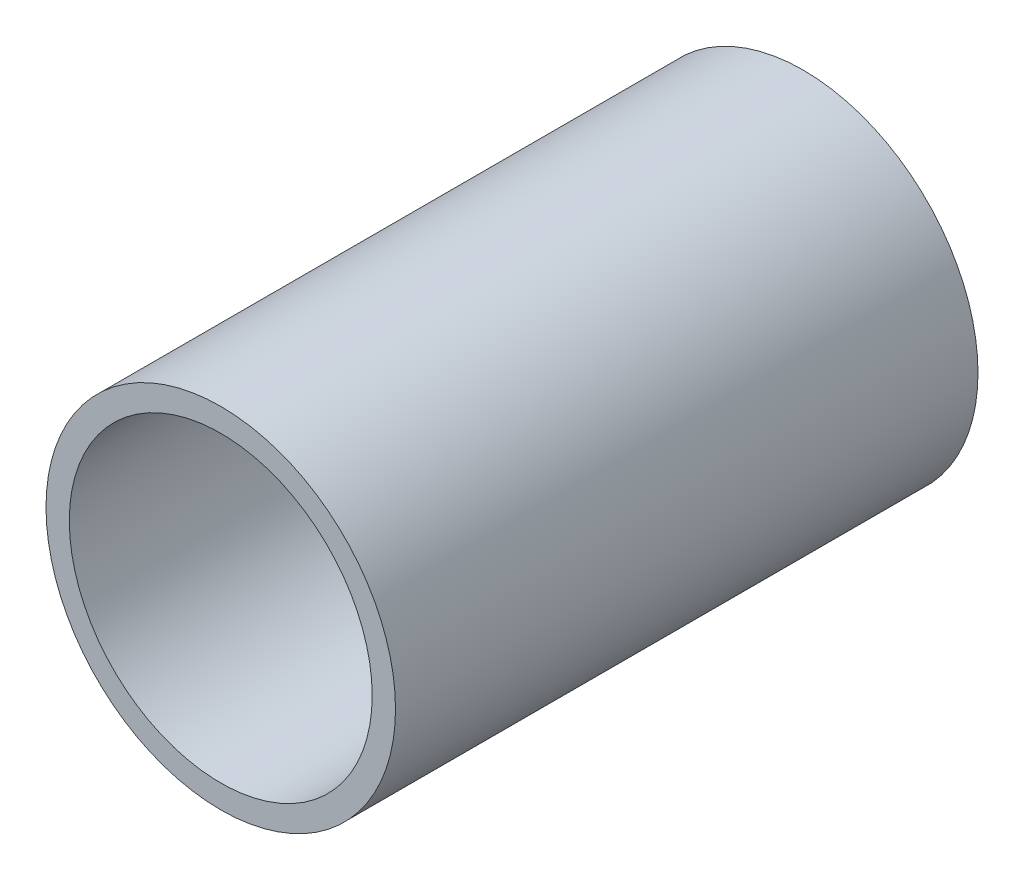
ISO-10303-21;
HEADER;
FILE_DESCRIPTION(('STEP AP214'),'2;1');
FILE_NAME('part.step','',(''),(''),'','','');
FILE_SCHEMA(('AUTOMOTIVE_DESIGN { 1 0 10303 214 1 1 1 1 }'));
ENDSEC;
DATA;
#1=APPLICATION_CONTEXT('core data for automotive mechanical design processes');
#2=APPLICATION_PROTOCOL_DEFINITION('international standard','automotive_design',2000,#1);
#3=PRODUCT_CONTEXT('',#1,'mechanical');
#4=PRODUCT('Part','Part','',(#3));
#5=PRODUCT_RELATED_PRODUCT_CATEGORY('part','',(#4));
#6=PRODUCT_DEFINITION_FORMATION('','',#4);
#7=PRODUCT_DEFINITION_CONTEXT('part definition',#1,'design');
#8=PRODUCT_DEFINITION('design','',#6,#7);
#9=PRODUCT_DEFINITION_SHAPE('','',#8);
#10=(LENGTH_UNIT() NAMED_UNIT(*) SI_UNIT(.MILLI.,.METRE.));
#11=(NAMED_UNIT(*) PLANE_ANGLE_UNIT() SI_UNIT($,.RADIAN.));
#12=(NAMED_UNIT(*) SI_UNIT($,.STERADIAN.) SOLID_ANGLE_UNIT());
#13=UNCERTAINTY_MEASURE_WITH_UNIT(LENGTH_MEASURE(1.E-05),#10,'distance_accuracy_value','');
#14=(GEOMETRIC_REPRESENTATION_CONTEXT(3) GLOBAL_UNCERTAINTY_ASSIGNED_CONTEXT((#13)) GLOBAL_UNIT_ASSIGNED_CONTEXT((#10,
#11,#12)) REPRESENTATION_CONTEXT('',''));
#15=CARTESIAN_POINT('',(0.,0.,0.));
#16=DIRECTION('',(0.,0.,1.));
#17=DIRECTION('',(1.,0.,0.));
#18=AXIS2_PLACEMENT_3D('',#15,#16,#17);
#19=CARTESIAN_POINT('',(0.,0.,50.));
#20=DIRECTION('',(0.,0.,1.));
#21=DIRECTION('',(1.,0.,0.));
#22=AXIS2_PLACEMENT_3D('',#19,#20,#21);
#23=PLANE('',#22);
#24=CARTESIAN_POINT('',(0.,0.,50.));
#25=DIRECTION('',(0.,0.,1.));
#26=DIRECTION('',(1.,0.,0.));
#27=AXIS2_PLACEMENT_3D('',#24,#25,#26);
#28=CIRCLE('',#27,15.);
#29=CARTESIAN_POINT('',(15.,0.,50.));
#30=VERTEX_POINT('',#29);
#31=EDGE_CURVE('E10',#30,#30,#28,.T.);
#32=ORIENTED_EDGE('',*,*,#31,.T.);
#33=EDGE_LOOP('',(#32));
#34=FACE_BOUND('',#33,.T.);
#35=CARTESIAN_POINT('',(0.,0.,50.));
#36=DIRECTION('',(0.,0.,1.));
#37=DIRECTION('',(1.,0.,0.));
#38=AXIS2_PLACEMENT_3D('',#35,#36,#37);
#39=CIRCLE('',#38,13.);
#40=CARTESIAN_POINT('',(13.,0.,50.));
#41=VERTEX_POINT('',#40);
#42=EDGE_CURVE('E42',#41,#41,#39,.T.);
#43=ORIENTED_EDGE('',*,*,#42,.F.);
#44=EDGE_LOOP('',(#43));
#45=FACE_BOUND('',#44,.T.);
#46=ADVANCED_FACE('F31',(#34,#45),#23,.T.);
#47=CARTESIAN_POINT('',(0.,0.,0.));
#48=DIRECTION('',(0.,0.,1.));
#49=DIRECTION('',(1.,0.,0.));
#50=AXIS2_PLACEMENT_3D('',#47,#48,#49);
#51=PLANE('',#50);
#52=CARTESIAN_POINT('',(0.,0.,0.));
#53=DIRECTION('',(0.,0.,1.));
#54=DIRECTION('',(1.,0.,0.));
#55=AXIS2_PLACEMENT_3D('',#52,#53,#54);
#56=CIRCLE('',#55,15.);
#57=CARTESIAN_POINT('',(15.,0.,0.));
#58=VERTEX_POINT('',#57);
#59=EDGE_CURVE('E35',#58,#58,#56,.T.);
#60=ORIENTED_EDGE('',*,*,#59,.F.);
#61=EDGE_LOOP('',(#60));
#62=FACE_BOUND('',#61,.T.);
#63=CARTESIAN_POINT('',(0.,0.,0.));
#64=DIRECTION('',(0.,0.,1.));
#65=DIRECTION('',(1.,0.,0.));
#66=AXIS2_PLACEMENT_3D('',#63,#64,#65);
#67=CIRCLE('',#66,13.);
#68=CARTESIAN_POINT('',(13.,0.,0.));
#69=VERTEX_POINT('',#68);
#70=EDGE_CURVE('E44',#69,#69,#67,.T.);
#71=ORIENTED_EDGE('',*,*,#70,.T.);
#72=EDGE_LOOP('',(#71));
#73=FACE_BOUND('',#72,.T.);
#74=ADVANCED_FACE('F54',(#62,#73),#51,.F.);
#75=CARTESIAN_POINT('',(0.,0.,50.));
#76=DIRECTION('',(0.,0.,-1.));
#77=DIRECTION('',(-1.,0.,0.));
#78=AXIS2_PLACEMENT_3D('',#75,#76,#77);
#79=CYLINDRICAL_SURFACE('',#78,15.);
#80=ORIENTED_EDGE('',*,*,#31,.F.);
#81=EDGE_LOOP('',(#80));
#82=FACE_BOUND('',#81,.T.);
#83=ORIENTED_EDGE('',*,*,#59,.T.);
#84=EDGE_LOOP('',(#83));
#85=FACE_BOUND('',#84,.T.);
#86=ADVANCED_FACE('F33',(#82,#85),#79,.T.);
#87=CARTESIAN_POINT('',(0.,0.,50.));
#88=DIRECTION('',(0.,0.,-1.));
#89=DIRECTION('',(-1.,0.,0.));
#90=AXIS2_PLACEMENT_3D('',#87,#88,#89);
#91=CYLINDRICAL_SURFACE('',#90,13.);
#92=ORIENTED_EDGE('',*,*,#42,.T.);
#93=EDGE_LOOP('',(#92));
#94=FACE_BOUND('',#93,.T.);
#95=ORIENTED_EDGE('',*,*,#70,.F.);
#96=EDGE_LOOP('',(#95));
#97=FACE_BOUND('',#96,.T.);
#98=ADVANCED_FACE('F50',(#94,#97),#91,.F.);
#99=CLOSED_SHELL('',(#46,#74,#86,#98));
#100=MANIFOLD_SOLID_BREP('B2',#99);
#101=ADVANCED_BREP_SHAPE_REPRESENTATION('',(#18,#100),#14);
#102=SHAPE_DEFINITION_REPRESENTATION(#9,#101);
ENDSEC;
END-ISO-10303-21;
